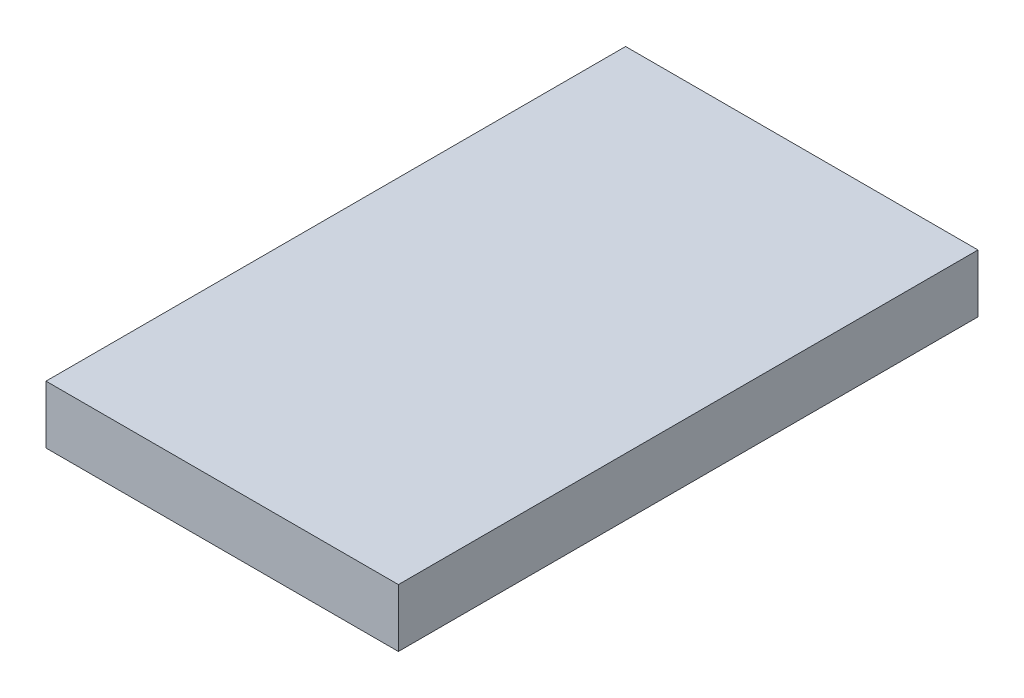
ISO-10303-21;
HEADER;
FILE_DESCRIPTION(('STEP AP214'),'2;1');
FILE_NAME('part.step','',(''),(''),'','','');
FILE_SCHEMA(('AUTOMOTIVE_DESIGN { 1 0 10303 214 1 1 1 1 }'));
ENDSEC;
DATA;
#1=APPLICATION_CONTEXT('core data for automotive mechanical design processes');
#2=APPLICATION_PROTOCOL_DEFINITION('international standard','automotive_design',2000,#1);
#3=PRODUCT_CONTEXT('',#1,'mechanical');
#4=PRODUCT('Part','Part','',(#3));
#5=PRODUCT_RELATED_PRODUCT_CATEGORY('part','',(#4));
#6=PRODUCT_DEFINITION_FORMATION('','',#4);
#7=PRODUCT_DEFINITION_CONTEXT('part definition',#1,'design');
#8=PRODUCT_DEFINITION('design','',#6,#7);
#9=PRODUCT_DEFINITION_SHAPE('','',#8);
#10=(LENGTH_UNIT() NAMED_UNIT(*) SI_UNIT(.MILLI.,.METRE.));
#11=(NAMED_UNIT(*) PLANE_ANGLE_UNIT() SI_UNIT($,.RADIAN.));
#12=(NAMED_UNIT(*) SI_UNIT($,.STERADIAN.) SOLID_ANGLE_UNIT());
#13=UNCERTAINTY_MEASURE_WITH_UNIT(LENGTH_MEASURE(1.E-05),#10,'distance_accuracy_value','');
#14=(GEOMETRIC_REPRESENTATION_CONTEXT(3) GLOBAL_UNCERTAINTY_ASSIGNED_CONTEXT((#13)) GLOBAL_UNIT_ASSIGNED_CONTEXT((#10,
#11,#12)) REPRESENTATION_CONTEXT('',''));
#15=CARTESIAN_POINT('',(0.,0.,0.));
#16=DIRECTION('',(0.,0.,1.));
#17=DIRECTION('',(1.,0.,0.));
#18=AXIS2_PLACEMENT_3D('',#15,#16,#17);
#19=CARTESIAN_POINT('',(-226.305,-17.025,10.));
#20=DIRECTION('',(1.,0.,0.));
#21=DIRECTION('',(0.,0.,-1.));
#22=AXIS2_PLACEMENT_3D('',#19,#20,#21);
#23=PLANE('',#22);
#24=DIRECTION('',(0.,-1.,0.));
#25=VECTOR('',#24,1.);
#26=CARTESIAN_POINT('',(-226.305,-17.025,0.));
#27=LINE('',#26,#25);
#28=CARTESIAN_POINT('',(-226.305,-16.025,0.));
#29=VERTEX_POINT('',#28);
#30=CARTESIAN_POINT('',(-226.305,-17.025,0.));
#31=VERTEX_POINT('',#30);
#32=EDGE_CURVE('E100',#29,#31,#27,.T.);
#33=ORIENTED_EDGE('',*,*,#32,.T.);
#34=DIRECTION('',(0.,0.,-1.));
#35=VECTOR('',#34,1.);
#36=CARTESIAN_POINT('',(-226.305,-17.025,10.));
#37=LINE('',#36,#35);
#38=CARTESIAN_POINT('',(-226.305,-17.025,10.));
#39=VERTEX_POINT('',#38);
#40=EDGE_CURVE('E11',#39,#31,#37,.T.);
#41=ORIENTED_EDGE('',*,*,#40,.F.);
#42=DIRECTION('',(0.,-1.,0.));
#43=VECTOR('',#42,1.);
#44=CARTESIAN_POINT('',(-226.305,-17.025,10.));
#45=LINE('',#44,#43);
#46=CARTESIAN_POINT('',(-226.305,-16.025,10.));
#47=VERTEX_POINT('',#46);
#48=EDGE_CURVE('E88',#47,#39,#45,.T.);
#49=ORIENTED_EDGE('',*,*,#48,.F.);
#50=DIRECTION('',(0.,0.,-1.));
#51=VECTOR('',#50,1.);
#52=CARTESIAN_POINT('',(-226.305,-16.025,10.));
#53=LINE('',#52,#51);
#54=EDGE_CURVE('E96',#47,#29,#53,.T.);
#55=ORIENTED_EDGE('',*,*,#54,.T.);
#56=EDGE_LOOP('',(#33,#41,#49,#55));
#57=FACE_BOUND('',#56,.T.);
#58=ADVANCED_FACE('F37',(#57),#23,.F.);
#59=CARTESIAN_POINT('',(-226.305,-17.025,10.));
#60=DIRECTION('',(0.,1.,0.));
#61=DIRECTION('',(0.,0.,1.));
#62=AXIS2_PLACEMENT_3D('',#59,#60,#61);
#63=PLANE('',#62);
#64=DIRECTION('',(1.,0.,0.));
#65=VECTOR('',#64,1.);
#66=CARTESIAN_POINT('',(-226.305,-17.025,0.));
#67=LINE('',#66,#65);
#68=CARTESIAN_POINT('',(-220.225,-17.025,0.));
#69=VERTEX_POINT('',#68);
#70=EDGE_CURVE('E92',#31,#69,#67,.T.);
#71=ORIENTED_EDGE('',*,*,#70,.T.);
#72=DIRECTION('',(0.,0.,-1.));
#73=VECTOR('',#72,1.);
#74=CARTESIAN_POINT('',(-220.225,-17.025,10.));
#75=LINE('',#74,#73);
#76=CARTESIAN_POINT('',(-220.225,-17.025,10.));
#77=VERTEX_POINT('',#76);
#78=EDGE_CURVE('E45',#77,#69,#75,.T.);
#79=ORIENTED_EDGE('',*,*,#78,.F.);
#80=DIRECTION('',(1.,0.,0.));
#81=VECTOR('',#80,1.);
#82=CARTESIAN_POINT('',(-226.305,-17.025,10.));
#83=LINE('',#82,#81);
#84=EDGE_CURVE('E83',#39,#77,#83,.T.);
#85=ORIENTED_EDGE('',*,*,#84,.F.);
#86=ORIENTED_EDGE('',*,*,#40,.T.);
#87=EDGE_LOOP('',(#71,#79,#85,#86));
#88=FACE_BOUND('',#87,.T.);
#89=ADVANCED_FACE('F91',(#88),#63,.F.);
#90=CARTESIAN_POINT('',(-220.225,-17.025,10.));
#91=DIRECTION('',(-1.,0.,0.));
#92=DIRECTION('',(0.,0.,1.));
#93=AXIS2_PLACEMENT_3D('',#90,#91,#92);
#94=PLANE('',#93);
#95=DIRECTION('',(0.,1.,0.));
#96=VECTOR('',#95,1.);
#97=CARTESIAN_POINT('',(-220.225,-17.025,0.));
#98=LINE('',#97,#96);
#99=CARTESIAN_POINT('',(-220.225,-16.025,0.));
#100=VERTEX_POINT('',#99);
#101=EDGE_CURVE('E70',#69,#100,#98,.T.);
#102=ORIENTED_EDGE('',*,*,#101,.T.);
#103=DIRECTION('',(0.,0.,-1.));
#104=VECTOR('',#103,1.);
#105=CARTESIAN_POINT('',(-220.225,-16.025,10.));
#106=LINE('',#105,#104);
#107=CARTESIAN_POINT('',(-220.225,-16.025,10.));
#108=VERTEX_POINT('',#107);
#109=EDGE_CURVE('E93',#108,#100,#106,.T.);
#110=ORIENTED_EDGE('',*,*,#109,.F.);
#111=DIRECTION('',(0.,1.,0.));
#112=VECTOR('',#111,1.);
#113=CARTESIAN_POINT('',(-220.225,-17.025,10.));
#114=LINE('',#113,#112);
#115=EDGE_CURVE('E86',#77,#108,#114,.T.);
#116=ORIENTED_EDGE('',*,*,#115,.F.);
#117=ORIENTED_EDGE('',*,*,#78,.T.);
#118=EDGE_LOOP('',(#102,#110,#116,#117));
#119=FACE_BOUND('',#118,.T.);
#120=ADVANCED_FACE('F94',(#119),#94,.F.);
#121=CARTESIAN_POINT('',(-226.305,-16.025,10.));
#122=DIRECTION('',(0.,-1.,0.));
#123=DIRECTION('',(0.,0.,-1.));
#124=AXIS2_PLACEMENT_3D('',#121,#122,#123);
#125=PLANE('',#124);
#126=DIRECTION('',(-1.,0.,0.));
#127=VECTOR('',#126,1.);
#128=CARTESIAN_POINT('',(-226.305,-16.025,0.));
#129=LINE('',#128,#127);
#130=EDGE_CURVE('E76',#100,#29,#129,.T.);
#131=ORIENTED_EDGE('',*,*,#130,.T.);
#132=ORIENTED_EDGE('',*,*,#54,.F.);
#133=DIRECTION('',(-1.,0.,0.));
#134=VECTOR('',#133,1.);
#135=CARTESIAN_POINT('',(-226.305,-16.025,10.));
#136=LINE('',#135,#134);
#137=EDGE_CURVE('E53',#108,#47,#136,.T.);
#138=ORIENTED_EDGE('',*,*,#137,.F.);
#139=ORIENTED_EDGE('',*,*,#109,.T.);
#140=EDGE_LOOP('',(#131,#132,#138,#139));
#141=FACE_BOUND('',#140,.T.);
#142=ADVANCED_FACE('F107',(#141),#125,.F.);
#143=CARTESIAN_POINT('',(0.,0.,10.));
#144=DIRECTION('',(0.,0.,-1.));
#145=DIRECTION('',(-1.,0.,0.));
#146=AXIS2_PLACEMENT_3D('',#143,#144,#145);
#147=PLANE('',#146);
#148=ORIENTED_EDGE('',*,*,#48,.T.);
#149=ORIENTED_EDGE('',*,*,#84,.T.);
#150=ORIENTED_EDGE('',*,*,#115,.T.);
#151=ORIENTED_EDGE('',*,*,#137,.T.);
#152=EDGE_LOOP('',(#148,#149,#150,#151));
#153=FACE_BOUND('',#152,.T.);
#154=ADVANCED_FACE('F84',(#153),#147,.F.);
#155=CARTESIAN_POINT('',(0.,0.,0.));
#156=DIRECTION('',(0.,0.,-1.));
#157=DIRECTION('',(-1.,0.,0.));
#158=AXIS2_PLACEMENT_3D('',#155,#156,#157);
#159=PLANE('',#158);
#160=ORIENTED_EDGE('',*,*,#32,.F.);
#161=ORIENTED_EDGE('',*,*,#130,.F.);
#162=ORIENTED_EDGE('',*,*,#101,.F.);
#163=ORIENTED_EDGE('',*,*,#70,.F.);
#164=EDGE_LOOP('',(#160,#161,#162,#163));
#165=FACE_BOUND('',#164,.T.);
#166=ADVANCED_FACE('F110',(#165),#159,.T.);
#167=CLOSED_SHELL('',(#58,#89,#120,#142,#154,#166));
#168=MANIFOLD_SOLID_BREP('B2',#167);
#169=ADVANCED_BREP_SHAPE_REPRESENTATION('',(#18,#168),#14);
#170=SHAPE_DEFINITION_REPRESENTATION(#9,#169);
ENDSEC;
END-ISO-10303-21;
